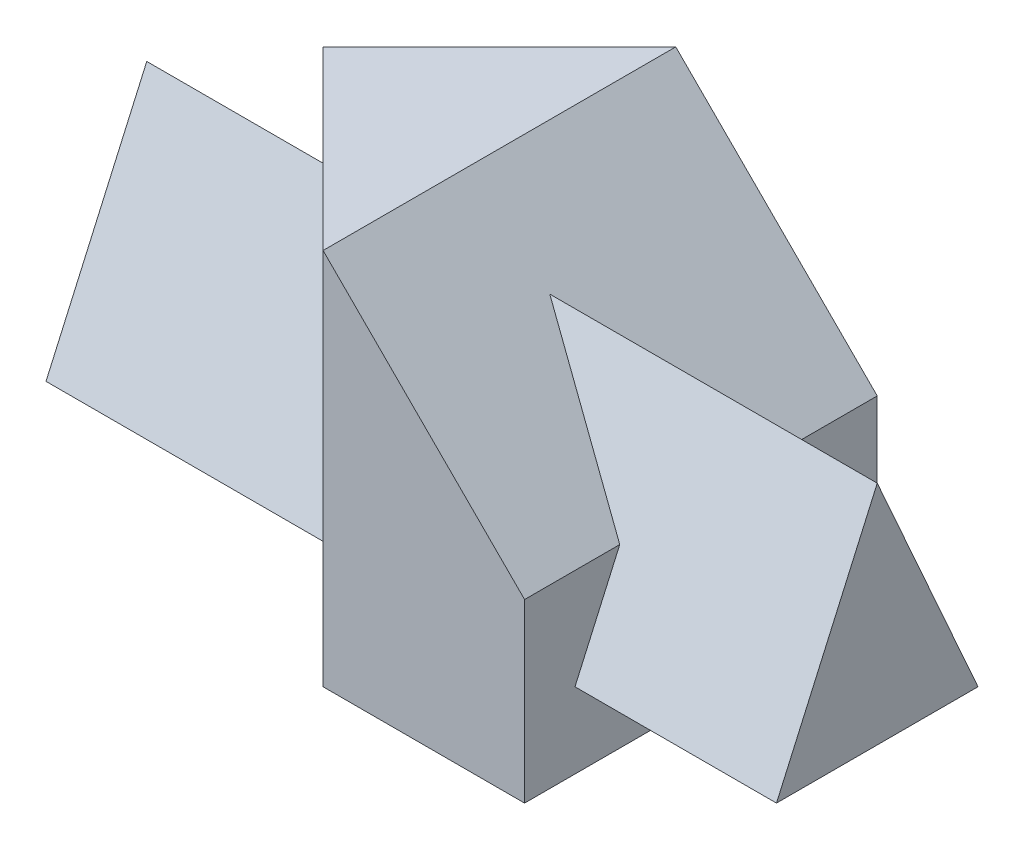
ISO-10303-21;
HEADER;
FILE_DESCRIPTION(('STEP AP214'),'2;1');
FILE_NAME('part.step','',(''),(''),'','','');
FILE_SCHEMA(('AUTOMOTIVE_DESIGN { 1 0 10303 214 1 1 1 1 }'));
ENDSEC;
DATA;
#1=APPLICATION_CONTEXT('core data for automotive mechanical design processes');
#2=APPLICATION_PROTOCOL_DEFINITION('international standard','automotive_design',2000,#1);
#3=PRODUCT_CONTEXT('',#1,'mechanical');
#4=PRODUCT('Part','Part','',(#3));
#5=PRODUCT_RELATED_PRODUCT_CATEGORY('part','',(#4));
#6=PRODUCT_DEFINITION_FORMATION('','',#4);
#7=PRODUCT_DEFINITION_CONTEXT('part definition',#1,'design');
#8=PRODUCT_DEFINITION('design','',#6,#7);
#9=PRODUCT_DEFINITION_SHAPE('','',#8);
#10=(LENGTH_UNIT() NAMED_UNIT(*) SI_UNIT(.MILLI.,.METRE.));
#11=(NAMED_UNIT(*) PLANE_ANGLE_UNIT() SI_UNIT($,.RADIAN.));
#12=(NAMED_UNIT(*) SI_UNIT($,.STERADIAN.) SOLID_ANGLE_UNIT());
#13=UNCERTAINTY_MEASURE_WITH_UNIT(LENGTH_MEASURE(1.E-05),#10,'distance_accuracy_value','');
#14=(GEOMETRIC_REPRESENTATION_CONTEXT(3) GLOBAL_UNCERTAINTY_ASSIGNED_CONTEXT((#13)) GLOBAL_UNIT_ASSIGNED_CONTEXT((#10,
#11,#12)) REPRESENTATION_CONTEXT('',''));
#15=CARTESIAN_POINT('',(0.,0.,0.));
#16=DIRECTION('',(0.,0.,1.));
#17=DIRECTION('',(1.,0.,0.));
#18=AXIS2_PLACEMENT_3D('',#15,#16,#17);
#19=CARTESIAN_POINT('',(35.,75.,35.));
#20=DIRECTION('',(0.707106781186547,0.,-0.707106781186548));
#21=DIRECTION('',(-0.707106781186548,0.,-0.707106781186547));
#22=AXIS2_PLACEMENT_3D('',#19,#20,#21);
#23=PLANE('',#22);
#24=DIRECTION('',(0.707106781186548,0.,0.707106781186547));
#25=VECTOR('',#24,1.);
#26=CARTESIAN_POINT('',(35.,15.,35.));
#27=LINE('',#26,#25);
#28=CARTESIAN_POINT('',(0.,15.,0.));
#29=VERTEX_POINT('',#28);
#30=CARTESIAN_POINT('',(25.,15.,25.));
#31=VERTEX_POINT('',#30);
#32=EDGE_CURVE('E131',#29,#31,#27,.T.);
#33=ORIENTED_EDGE('',*,*,#32,.F.);
#34=DIRECTION('',(0.,-1.,0.));
#35=VECTOR('',#34,1.);
#36=CARTESIAN_POINT('',(0.,75.,0.));
#37=LINE('',#36,#35);
#38=CARTESIAN_POINT('',(0.,0.,0.));
#39=VERTEX_POINT('',#38);
#40=EDGE_CURVE('E210',#29,#39,#37,.T.);
#41=ORIENTED_EDGE('',*,*,#40,.T.);
#42=DIRECTION('',(0.707106781186548,0.,0.707106781186547));
#43=VECTOR('',#42,1.);
#44=CARTESIAN_POINT('',(35.,0.,35.));
#45=LINE('',#44,#43);
#46=CARTESIAN_POINT('',(35.,0.,35.));
#47=VERTEX_POINT('',#46);
#48=EDGE_CURVE('E189',#39,#47,#45,.T.);
#49=ORIENTED_EDGE('',*,*,#48,.T.);
#50=DIRECTION('',(0.,-1.,0.));
#51=VECTOR('',#50,1.);
#52=CARTESIAN_POINT('',(35.,75.,35.));
#53=LINE('',#52,#51);
#54=CARTESIAN_POINT('',(35.,75.,35.));
#55=VERTEX_POINT('',#54);
#56=EDGE_CURVE('E220',#55,#47,#53,.T.);
#57=ORIENTED_EDGE('',*,*,#56,.F.);
#58=DIRECTION('',(0.707106781186548,0.,0.707106781186547));
#59=VECTOR('',#58,1.);
#60=CARTESIAN_POINT('',(35.,75.,35.));
#61=LINE('',#60,#59);
#62=CARTESIAN_POINT('',(0.,75.,0.));
#63=VERTEX_POINT('',#62);
#64=EDGE_CURVE('E205',#63,#55,#61,.T.);
#65=ORIENTED_EDGE('',*,*,#64,.F.);
#66=CARTESIAN_POINT('',(0.,48.75,0.));
#67=VERTEX_POINT('',#66);
#68=EDGE_CURVE('E211',#63,#67,#37,.T.);
#69=ORIENTED_EDGE('',*,*,#68,.T.);
#70=DIRECTION('',(-0.376288347353439,-0.846648781545238,-0.376288347353439));
#71=VECTOR('',#70,1.);
#72=CARTESIAN_POINT('',(18.2743362831858,89.8672566371682,18.2743362831858));
#73=LINE('',#72,#71);
#74=CARTESIAN_POINT('',(4.99999999999999,60.,4.99999999999999));
#75=VERTEX_POINT('',#74);
#76=EDGE_CURVE('E51',#75,#67,#73,.T.);
#77=ORIENTED_EDGE('',*,*,#76,.F.);
#78=DIRECTION('',(-0.376288347353439,0.846648781545237,-0.376288347353439));
#79=VECTOR('',#78,1.);
#80=CARTESIAN_POINT('',(8.71681415929205,51.6371681415929,8.71681415929204));
#81=LINE('',#80,#79);
#82=EDGE_CURVE('E46',#31,#75,#81,.T.);
#83=ORIENTED_EDGE('',*,*,#82,.F.);
#84=EDGE_LOOP('',(#33,#41,#49,#57,#65,#69,#77,#83));
#85=FACE_BOUND('',#84,.T.);
#86=ADVANCED_FACE('F32',(#85),#23,.F.);
#87=CARTESIAN_POINT('',(75.,75.,-35.));
#88=DIRECTION('',(-1.,0.,0.));
#89=DIRECTION('',(0.,0.,1.));
#90=AXIS2_PLACEMENT_3D('',#87,#88,#89);
#91=PLANE('',#90);
#92=DIRECTION('',(0.,-0.913811548620257,0.406138466053448));
#93=VECTOR('',#92,1.);
#94=CARTESIAN_POINT('',(75.,87.3711340206186,-7.16494845360828));
#95=LINE('',#94,#93);
#96=CARTESIAN_POINT('',(75.,35.,16.1111111111111));
#97=VERTEX_POINT('',#96);
#98=CARTESIAN_POINT('',(75.,15.,25.));
#99=VERTEX_POINT('',#98);
#100=EDGE_CURVE('E171',#97,#99,#95,.T.);
#101=ORIENTED_EDGE('',*,*,#100,.F.);
#102=DIRECTION('',(0.,0.,1.));
#103=VECTOR('',#102,1.);
#104=CARTESIAN_POINT('',(75.,35.,-35.));
#105=LINE('',#104,#103);
#106=CARTESIAN_POINT('',(75.,35.,35.));
#107=VERTEX_POINT('',#106);
#108=EDGE_CURVE('E190',#97,#107,#105,.T.);
#109=ORIENTED_EDGE('',*,*,#108,.T.);
#110=DIRECTION('',(0.,-1.,0.));
#111=VECTOR('',#110,1.);
#112=CARTESIAN_POINT('',(75.,75.,35.));
#113=LINE('',#112,#111);
#114=CARTESIAN_POINT('',(75.,0.,35.));
#115=VERTEX_POINT('',#114);
#116=EDGE_CURVE('E218',#107,#115,#113,.T.);
#117=ORIENTED_EDGE('',*,*,#116,.T.);
#118=DIRECTION('',(0.,0.,-1.));
#119=VECTOR('',#118,1.);
#120=CARTESIAN_POINT('',(75.,0.,-35.));
#121=LINE('',#120,#119);
#122=CARTESIAN_POINT('',(75.,0.,-35.));
#123=VERTEX_POINT('',#122);
#124=EDGE_CURVE('E197',#115,#123,#121,.T.);
#125=ORIENTED_EDGE('',*,*,#124,.T.);
#126=DIRECTION('',(0.,-1.,0.));
#127=VECTOR('',#126,1.);
#128=CARTESIAN_POINT('',(75.,75.,-35.));
#129=LINE('',#128,#127);
#130=CARTESIAN_POINT('',(75.,35.,-35.));
#131=VERTEX_POINT('',#130);
#132=EDGE_CURVE('E216',#131,#123,#129,.T.);
#133=ORIENTED_EDGE('',*,*,#132,.F.);
#134=CARTESIAN_POINT('',(75.,35.,-6.11111111111112));
#135=VERTEX_POINT('',#134);
#136=EDGE_CURVE('E186',#131,#135,#105,.T.);
#137=ORIENTED_EDGE('',*,*,#136,.T.);
#138=DIRECTION('',(0.,0.913811548620257,0.406138466053448));
#139=VECTOR('',#138,1.);
#140=CARTESIAN_POINT('',(75.,57.680412371134,3.96907216494842));
#141=LINE('',#140,#139);
#142=CARTESIAN_POINT('',(75.,15.,-15.));
#143=VERTEX_POINT('',#142);
#144=EDGE_CURVE('E164',#143,#135,#141,.T.);
#145=ORIENTED_EDGE('',*,*,#144,.F.);
#146=DIRECTION('',(0.,0.,-1.));
#147=VECTOR('',#146,1.);
#148=CARTESIAN_POINT('',(75.,15.,-35.));
#149=LINE('',#148,#147);
#150=EDGE_CURVE('E176',#99,#143,#149,.T.);
#151=ORIENTED_EDGE('',*,*,#150,.F.);
#152=EDGE_LOOP('',(#101,#109,#117,#125,#133,#137,#145,#151));
#153=FACE_BOUND('',#152,.T.);
#154=ADVANCED_FACE('F239',(#153),#91,.F.);
#155=CARTESIAN_POINT('',(0.,75.,0.));
#156=DIRECTION('',(0.707106781186548,0.,0.707106781186547));
#157=DIRECTION('',(0.707106781186547,0.,-0.707106781186548));
#158=AXIS2_PLACEMENT_3D('',#155,#156,#157);
#159=PLANE('',#158);
#160=DIRECTION('',(-0.707106781186547,0.,0.707106781186548));
#161=VECTOR('',#160,1.);
#162=CARTESIAN_POINT('',(0.,15.,0.));
#163=LINE('',#162,#161);
#164=CARTESIAN_POINT('',(15.,15.,-15.));
#165=VERTEX_POINT('',#164);
#166=EDGE_CURVE('E11',#165,#29,#163,.T.);
#167=ORIENTED_EDGE('',*,*,#166,.F.);
#168=DIRECTION('',(0.376288347353439,-0.846648781545238,-0.376288347353439));
#169=VECTOR('',#168,1.);
#170=CARTESIAN_POINT('',(-8.36283185840707,67.5663716814159,8.36283185840708));
#171=LINE('',#170,#169);
#172=EDGE_CURVE('E167',#67,#165,#171,.T.);
#173=ORIENTED_EDGE('',*,*,#172,.F.);
#174=ORIENTED_EDGE('',*,*,#68,.F.);
#175=DIRECTION('',(-0.707106781186547,0.,0.707106781186548));
#176=VECTOR('',#175,1.);
#177=CARTESIAN_POINT('',(0.,75.,0.));
#178=LINE('',#177,#176);
#179=CARTESIAN_POINT('',(35.,75.,-35.));
#180=VERTEX_POINT('',#179);
#181=EDGE_CURVE('E208',#180,#63,#178,.T.);
#182=ORIENTED_EDGE('',*,*,#181,.F.);
#183=DIRECTION('',(0.,-1.,0.));
#184=VECTOR('',#183,1.);
#185=CARTESIAN_POINT('',(35.,75.,-35.));
#186=LINE('',#185,#184);
#187=CARTESIAN_POINT('',(35.,0.,-35.));
#188=VERTEX_POINT('',#187);
#189=EDGE_CURVE('E213',#180,#188,#186,.T.);
#190=ORIENTED_EDGE('',*,*,#189,.T.);
#191=DIRECTION('',(-0.707106781186547,0.,0.707106781186548));
#192=VECTOR('',#191,1.);
#193=CARTESIAN_POINT('',(0.,0.,0.));
#194=LINE('',#193,#192);
#195=EDGE_CURVE('E202',#188,#39,#194,.T.);
#196=ORIENTED_EDGE('',*,*,#195,.T.);
#197=ORIENTED_EDGE('',*,*,#40,.F.);
#198=EDGE_LOOP('',(#167,#173,#174,#182,#190,#196,#197));
#199=FACE_BOUND('',#198,.T.);
#200=ADVANCED_FACE('F262',(#199),#159,.F.);
#201=CARTESIAN_POINT('',(35.,75.,-35.));
#202=DIRECTION('',(-0.707106781186547,-0.707106781186548,0.));
#203=DIRECTION('',(0.707106781186548,-0.707106781186547,0.));
#204=AXIS2_PLACEMENT_3D('',#201,#202,#203);
#205=PLANE('',#204);
#206=DIRECTION('',(0.674578520096275,-0.674578520096275,0.299812675598344));
#207=VECTOR('',#206,1.);
#208=CARTESIAN_POINT('',(28.2584269662922,81.7415730337079,-4.66292134831462));
#209=LINE('',#208,#207);
#210=CARTESIAN_POINT('',(50.,60.,4.99999999999999));
#211=VERTEX_POINT('',#210);
#212=EDGE_CURVE('E39',#211,#97,#209,.T.);
#213=ORIENTED_EDGE('',*,*,#212,.F.);
#214=DIRECTION('',(-0.674578520096275,0.674578520096275,0.299812675598345));
#215=VECTOR('',#214,1.);
#216=CARTESIAN_POINT('',(44.438202247191,65.561797752809,7.47191011235952));
#217=LINE('',#216,#215);
#218=EDGE_CURVE('E223',#135,#211,#217,.T.);
#219=ORIENTED_EDGE('',*,*,#218,.F.);
#220=ORIENTED_EDGE('',*,*,#136,.F.);
#221=DIRECTION('',(0.707106781186548,-0.707106781186547,0.));
#222=VECTOR('',#221,1.);
#223=CARTESIAN_POINT('',(35.,75.,-35.));
#224=LINE('',#223,#222);
#225=EDGE_CURVE('E182',#180,#131,#224,.T.);
#226=ORIENTED_EDGE('',*,*,#225,.F.);
#227=DIRECTION('',(0.,0.,1.));
#228=VECTOR('',#227,1.);
#229=CARTESIAN_POINT('',(35.,75.,-35.));
#230=LINE('',#229,#228);
#231=EDGE_CURVE('E185',#180,#55,#230,.T.);
#232=ORIENTED_EDGE('',*,*,#231,.T.);
#233=DIRECTION('',(0.707106781186548,-0.707106781186547,0.));
#234=VECTOR('',#233,1.);
#235=CARTESIAN_POINT('',(35.,75.,35.));
#236=LINE('',#235,#234);
#237=EDGE_CURVE('E179',#55,#107,#236,.T.);
#238=ORIENTED_EDGE('',*,*,#237,.T.);
#239=ORIENTED_EDGE('',*,*,#108,.F.);
#240=EDGE_LOOP('',(#213,#219,#220,#226,#232,#238,#239));
#241=FACE_BOUND('',#240,.T.);
#242=ADVANCED_FACE('F233',(#241),#205,.F.);
#243=CARTESIAN_POINT('',(75.,75.,35.));
#244=DIRECTION('',(0.,0.,-1.));
#245=DIRECTION('',(-1.,0.,0.));
#246=AXIS2_PLACEMENT_3D('',#243,#244,#245);
#247=PLANE('',#246);
#248=ORIENTED_EDGE('',*,*,#116,.F.);
#249=ORIENTED_EDGE('',*,*,#237,.F.);
#250=ORIENTED_EDGE('',*,*,#56,.T.);
#251=DIRECTION('',(1.,0.,0.));
#252=VECTOR('',#251,1.);
#253=CARTESIAN_POINT('',(75.,0.,35.));
#254=LINE('',#253,#252);
#255=EDGE_CURVE('E194',#47,#115,#254,.T.);
#256=ORIENTED_EDGE('',*,*,#255,.T.);
#257=EDGE_LOOP('',(#248,#249,#250,#256));
#258=FACE_BOUND('',#257,.T.);
#259=ADVANCED_FACE('F282',(#258),#247,.F.);
#260=CARTESIAN_POINT('',(35.,75.,-35.));
#261=DIRECTION('',(0.,0.,1.));
#262=DIRECTION('',(1.,0.,0.));
#263=AXIS2_PLACEMENT_3D('',#260,#261,#262);
#264=PLANE('',#263);
#265=ORIENTED_EDGE('',*,*,#189,.F.);
#266=ORIENTED_EDGE('',*,*,#225,.T.);
#267=ORIENTED_EDGE('',*,*,#132,.T.);
#268=DIRECTION('',(-1.,0.,0.));
#269=VECTOR('',#268,1.);
#270=CARTESIAN_POINT('',(35.,0.,-35.));
#271=LINE('',#270,#269);
#272=EDGE_CURVE('E200',#123,#188,#271,.T.);
#273=ORIENTED_EDGE('',*,*,#272,.T.);
#274=EDGE_LOOP('',(#265,#266,#267,#273));
#275=FACE_BOUND('',#274,.T.);
#276=ADVANCED_FACE('F283',(#275),#264,.F.);
#277=CARTESIAN_POINT('',(0.,75.,0.));
#278=DIRECTION('',(0.,-1.,0.));
#279=DIRECTION('',(0.,0.,-1.));
#280=AXIS2_PLACEMENT_3D('',#277,#278,#279);
#281=PLANE('',#280);
#282=ORIENTED_EDGE('',*,*,#64,.T.);
#283=ORIENTED_EDGE('',*,*,#231,.F.);
#284=ORIENTED_EDGE('',*,*,#181,.T.);
#285=EDGE_LOOP('',(#282,#283,#284));
#286=FACE_BOUND('',#285,.T.);
#287=ADVANCED_FACE('F254',(#286),#281,.F.);
#288=CARTESIAN_POINT('',(0.,0.,0.));
#289=DIRECTION('',(0.,-1.,0.));
#290=DIRECTION('',(0.,0.,-1.));
#291=AXIS2_PLACEMENT_3D('',#288,#289,#290);
#292=PLANE('',#291);
#293=ORIENTED_EDGE('',*,*,#48,.F.);
#294=ORIENTED_EDGE('',*,*,#195,.F.);
#295=ORIENTED_EDGE('',*,*,#272,.F.);
#296=ORIENTED_EDGE('',*,*,#124,.F.);
#297=ORIENTED_EDGE('',*,*,#255,.F.);
#298=EDGE_LOOP('',(#293,#294,#295,#296,#297));
#299=FACE_BOUND('',#298,.T.);
#300=ADVANCED_FACE('F246',(#299),#292,.T.);
#301=CARTESIAN_POINT('',(115.,15.,25.));
#302=DIRECTION('',(1.,0.,0.));
#303=DIRECTION('',(0.,0.,-1.));
#304=AXIS2_PLACEMENT_3D('',#301,#302,#303);
#305=PLANE('',#304);
#306=DIRECTION('',(0.,-0.913811548620257,0.406138466053448));
#307=VECTOR('',#306,1.);
#308=CARTESIAN_POINT('',(115.,60.,4.99999999999995));
#309=LINE('',#308,#307);
#310=CARTESIAN_POINT('',(115.,60.,4.99999999999995));
#311=VERTEX_POINT('',#310);
#312=CARTESIAN_POINT('',(115.,15.,25.));
#313=VERTEX_POINT('',#312);
#314=EDGE_CURVE('E150',#311,#313,#309,.T.);
#315=ORIENTED_EDGE('',*,*,#314,.T.);
#316=DIRECTION('',(0.,0.,-1.));
#317=VECTOR('',#316,1.);
#318=CARTESIAN_POINT('',(115.,15.,25.));
#319=LINE('',#318,#317);
#320=CARTESIAN_POINT('',(115.,15.,-15.));
#321=VERTEX_POINT('',#320);
#322=EDGE_CURVE('E153',#313,#321,#319,.T.);
#323=ORIENTED_EDGE('',*,*,#322,.T.);
#324=DIRECTION('',(0.,0.913811548620257,0.406138466053447));
#325=VECTOR('',#324,1.);
#326=CARTESIAN_POINT('',(115.,15.,-15.));
#327=LINE('',#326,#325);
#328=EDGE_CURVE('E155',#321,#311,#327,.T.);
#329=ORIENTED_EDGE('',*,*,#328,.T.);
#330=EDGE_LOOP('',(#315,#323,#329));
#331=FACE_BOUND('',#330,.T.);
#332=ADVANCED_FACE('F244',(#331),#305,.T.);
#333=CARTESIAN_POINT('',(115.,15.,-15.));
#334=DIRECTION('',(0.,-0.406138466053447,0.913811548620257));
#335=DIRECTION('',(0.,-0.913811548620257,-0.406138466053448));
#336=AXIS2_PLACEMENT_3D('',#333,#334,#335);
#337=PLANE('',#336);
#338=DIRECTION('',(-1.,0.,0.));
#339=VECTOR('',#338,1.);
#340=CARTESIAN_POINT('',(115.,15.,-15.));
#341=LINE('',#340,#339);
#342=EDGE_CURVE('E135',#321,#143,#341,.T.);
#343=ORIENTED_EDGE('',*,*,#342,.T.);
#344=ORIENTED_EDGE('',*,*,#144,.T.);
#345=ORIENTED_EDGE('',*,*,#218,.T.);
#346=DIRECTION('',(-1.,0.,0.));
#347=VECTOR('',#346,1.);
#348=CARTESIAN_POINT('',(115.,60.,4.99999999999995));
#349=LINE('',#348,#347);
#350=EDGE_CURVE('E157',#311,#211,#349,.T.);
#351=ORIENTED_EDGE('',*,*,#350,.F.);
#352=ORIENTED_EDGE('',*,*,#328,.F.);
#353=EDGE_LOOP('',(#343,#344,#345,#351,#352));
#354=FACE_BOUND('',#353,.T.);
#355=ADVANCED_FACE('F235',(#354),#337,.F.);
#356=CARTESIAN_POINT('',(115.,60.,4.99999999999995));
#357=DIRECTION('',(0.,-0.406138466053448,-0.913811548620257));
#358=DIRECTION('',(0.,0.913811548620257,-0.406138466053448));
#359=AXIS2_PLACEMENT_3D('',#356,#357,#358);
#360=PLANE('',#359);
#361=ORIENTED_EDGE('',*,*,#212,.T.);
#362=ORIENTED_EDGE('',*,*,#100,.T.);
#363=DIRECTION('',(-1.,0.,0.));
#364=VECTOR('',#363,1.);
#365=CARTESIAN_POINT('',(115.,15.,25.));
#366=LINE('',#365,#364);
#367=EDGE_CURVE('E134',#313,#99,#366,.T.);
#368=ORIENTED_EDGE('',*,*,#367,.F.);
#369=ORIENTED_EDGE('',*,*,#314,.F.);
#370=ORIENTED_EDGE('',*,*,#350,.T.);
#371=EDGE_LOOP('',(#361,#362,#368,#369,#370));
#372=FACE_BOUND('',#371,.T.);
#373=ADVANCED_FACE('F227',(#372),#360,.F.);
#374=CARTESIAN_POINT('',(115.,15.,25.));
#375=DIRECTION('',(0.,1.,0.));
#376=DIRECTION('',(0.,0.,1.));
#377=AXIS2_PLACEMENT_3D('',#374,#375,#376);
#378=PLANE('',#377);
#379=ORIENTED_EDGE('',*,*,#367,.T.);
#380=ORIENTED_EDGE('',*,*,#150,.T.);
#381=ORIENTED_EDGE('',*,*,#342,.F.);
#382=ORIENTED_EDGE('',*,*,#322,.F.);
#383=EDGE_LOOP('',(#379,#380,#381,#382));
#384=FACE_BOUND('',#383,.T.);
#385=ADVANCED_FACE('F242',(#384),#378,.F.);
#386=ORIENTED_EDGE('',*,*,#166,.T.);
#387=ORIENTED_EDGE('',*,*,#32,.T.);
#388=CARTESIAN_POINT('',(-30.,15.,25.));
#389=VERTEX_POINT('',#388);
#390=EDGE_CURVE('E125',#31,#389,#366,.T.);
#391=ORIENTED_EDGE('',*,*,#390,.T.);
#392=DIRECTION('',(0.,0.,-1.));
#393=VECTOR('',#392,1.);
#394=CARTESIAN_POINT('',(-30.,15.,25.));
#395=LINE('',#394,#393);
#396=CARTESIAN_POINT('',(-30.,15.,-15.));
#397=VERTEX_POINT('',#396);
#398=EDGE_CURVE('E129',#389,#397,#395,.T.);
#399=ORIENTED_EDGE('',*,*,#398,.T.);
#400=EDGE_CURVE('E160',#165,#397,#341,.T.);
#401=ORIENTED_EDGE('',*,*,#400,.F.);
#402=EDGE_LOOP('',(#386,#387,#391,#399,#401));
#403=FACE_BOUND('',#402,.T.);
#404=ADVANCED_FACE('F127',(#403),#378,.F.);
#405=ORIENTED_EDGE('',*,*,#390,.F.);
#406=ORIENTED_EDGE('',*,*,#82,.T.);
#407=CARTESIAN_POINT('',(-30.,60.,5.00000000000001));
#408=VERTEX_POINT('',#407);
#409=EDGE_CURVE('E146',#75,#408,#349,.T.);
#410=ORIENTED_EDGE('',*,*,#409,.T.);
#411=DIRECTION('',(0.,-0.913811548620257,0.406138466053448));
#412=VECTOR('',#411,1.);
#413=CARTESIAN_POINT('',(-30.,60.,5.00000000000001));
#414=LINE('',#413,#412);
#415=EDGE_CURVE('E140',#408,#389,#414,.T.);
#416=ORIENTED_EDGE('',*,*,#415,.T.);
#417=EDGE_LOOP('',(#405,#406,#410,#416));
#418=FACE_BOUND('',#417,.T.);
#419=ADVANCED_FACE('F144',(#418),#360,.F.);
#420=ORIENTED_EDGE('',*,*,#409,.F.);
#421=ORIENTED_EDGE('',*,*,#76,.T.);
#422=ORIENTED_EDGE('',*,*,#172,.T.);
#423=ORIENTED_EDGE('',*,*,#400,.T.);
#424=DIRECTION('',(0.,0.913811548620257,0.406138466053447));
#425=VECTOR('',#424,1.);
#426=CARTESIAN_POINT('',(-30.,15.,-15.));
#427=LINE('',#426,#425);
#428=EDGE_CURVE('E142',#397,#408,#427,.T.);
#429=ORIENTED_EDGE('',*,*,#428,.T.);
#430=EDGE_LOOP('',(#420,#421,#422,#423,#429));
#431=FACE_BOUND('',#430,.T.);
#432=ADVANCED_FACE('F253',(#431),#337,.F.);
#433=CARTESIAN_POINT('',(-30.,15.,25.));
#434=DIRECTION('',(1.,0.,0.));
#435=DIRECTION('',(0.,0.,-1.));
#436=AXIS2_PLACEMENT_3D('',#433,#434,#435);
#437=PLANE('',#436);
#438=ORIENTED_EDGE('',*,*,#415,.F.);
#439=ORIENTED_EDGE('',*,*,#428,.F.);
#440=ORIENTED_EDGE('',*,*,#398,.F.);
#441=EDGE_LOOP('',(#438,#439,#440));
#442=FACE_BOUND('',#441,.T.);
#443=ADVANCED_FACE('F139',(#442),#437,.F.);
#444=CLOSED_SHELL('',(#86,#154,#200,#242,#259,#276,#287,#300,#332,#355,#373,#385,#404,#419,#432,#443));
#445=MANIFOLD_SOLID_BREP('B2',#444);
#446=ADVANCED_BREP_SHAPE_REPRESENTATION('',(#18,#445),#14);
#447=SHAPE_DEFINITION_REPRESENTATION(#9,#446);
ENDSEC;
END-ISO-10303-21;
